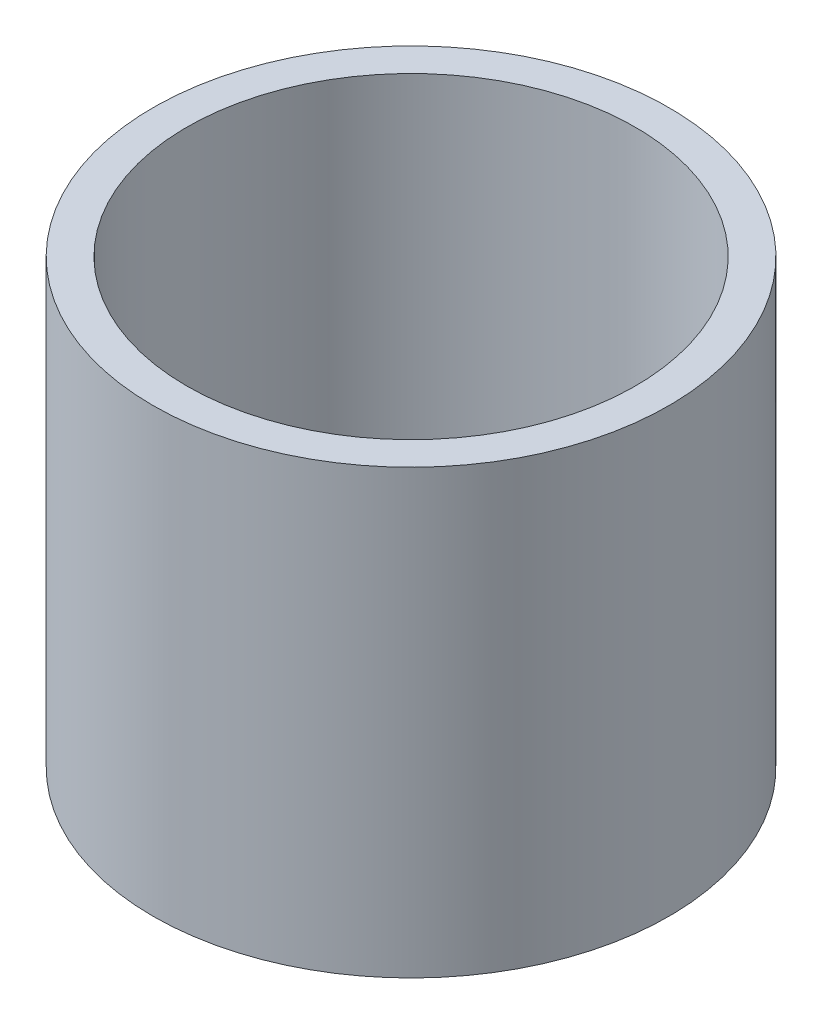
ISO-10303-21;
HEADER;
FILE_DESCRIPTION(('STEP AP214'),'2;1');
FILE_NAME('part.step','',(''),(''),'','','');
FILE_SCHEMA(('AUTOMOTIVE_DESIGN { 1 0 10303 214 1 1 1 1 }'));
ENDSEC;
DATA;
#1=APPLICATION_CONTEXT('core data for automotive mechanical design processes');
#2=APPLICATION_PROTOCOL_DEFINITION('international standard','automotive_design',2000,#1);
#3=PRODUCT_CONTEXT('',#1,'mechanical');
#4=PRODUCT('Part','Part','',(#3));
#5=PRODUCT_RELATED_PRODUCT_CATEGORY('part','',(#4));
#6=PRODUCT_DEFINITION_FORMATION('','',#4);
#7=PRODUCT_DEFINITION_CONTEXT('part definition',#1,'design');
#8=PRODUCT_DEFINITION('design','',#6,#7);
#9=PRODUCT_DEFINITION_SHAPE('','',#8);
#10=(LENGTH_UNIT() NAMED_UNIT(*) SI_UNIT(.MILLI.,.METRE.));
#11=(NAMED_UNIT(*) PLANE_ANGLE_UNIT() SI_UNIT($,.RADIAN.));
#12=(NAMED_UNIT(*) SI_UNIT($,.STERADIAN.) SOLID_ANGLE_UNIT());
#13=UNCERTAINTY_MEASURE_WITH_UNIT(LENGTH_MEASURE(1.E-05),#10,'distance_accuracy_value','');
#14=(GEOMETRIC_REPRESENTATION_CONTEXT(3) GLOBAL_UNCERTAINTY_ASSIGNED_CONTEXT((#13)) GLOBAL_UNIT_ASSIGNED_CONTEXT((#10,
#11,#12)) REPRESENTATION_CONTEXT('',''));
#15=CARTESIAN_POINT('',(0.,0.,0.));
#16=DIRECTION('',(0.,0.,1.));
#17=DIRECTION('',(1.,0.,0.));
#18=AXIS2_PLACEMENT_3D('',#15,#16,#17);
#19=CARTESIAN_POINT('',(0.,76.2,0.));
#20=DIRECTION('',(0.,1.,0.));
#21=DIRECTION('',(0.,0.,1.));
#22=AXIS2_PLACEMENT_3D('',#19,#20,#21);
#23=PLANE('',#22);
#24=CARTESIAN_POINT('',(0.,76.2,0.));
#25=DIRECTION('',(0.,1.,0.));
#26=DIRECTION('',(0.,0.,1.));
#27=AXIS2_PLACEMENT_3D('',#24,#25,#26);
#28=CIRCLE('',#27,44.45);
#29=CARTESIAN_POINT('',(0.,76.2,44.45));
#30=VERTEX_POINT('',#29);
#31=EDGE_CURVE('E10',#30,#30,#28,.T.);
#32=ORIENTED_EDGE('',*,*,#31,.T.);
#33=EDGE_LOOP('',(#32));
#34=FACE_BOUND('',#33,.T.);
#35=CARTESIAN_POINT('',(0.,76.2,0.));
#36=DIRECTION('',(0.,1.,0.));
#37=DIRECTION('',(0.,0.,1.));
#38=AXIS2_PLACEMENT_3D('',#35,#36,#37);
#39=CIRCLE('',#38,38.6334);
#40=CARTESIAN_POINT('',(0.,76.2,38.6334));
#41=VERTEX_POINT('',#40);
#42=EDGE_CURVE('E51',#41,#41,#39,.T.);
#43=ORIENTED_EDGE('',*,*,#42,.F.);
#44=EDGE_LOOP('',(#43));
#45=FACE_BOUND('',#44,.T.);
#46=ADVANCED_FACE('F38',(#34,#45),#23,.T.);
#47=CARTESIAN_POINT('',(0.,0.,0.));
#48=DIRECTION('',(0.,1.,0.));
#49=DIRECTION('',(0.,0.,1.));
#50=AXIS2_PLACEMENT_3D('',#47,#48,#49);
#51=PLANE('',#50);
#52=CARTESIAN_POINT('',(0.,0.,0.));
#53=DIRECTION('',(0.,1.,0.));
#54=DIRECTION('',(0.,0.,1.));
#55=AXIS2_PLACEMENT_3D('',#52,#53,#54);
#56=CIRCLE('',#55,44.45);
#57=CARTESIAN_POINT('',(0.,0.,44.45));
#58=VERTEX_POINT('',#57);
#59=EDGE_CURVE('E42',#58,#58,#56,.T.);
#60=ORIENTED_EDGE('',*,*,#59,.F.);
#61=EDGE_LOOP('',(#60));
#62=FACE_BOUND('',#61,.T.);
#63=CARTESIAN_POINT('',(0.,0.,0.));
#64=DIRECTION('',(0.,1.,0.));
#65=DIRECTION('',(0.,0.,1.));
#66=AXIS2_PLACEMENT_3D('',#63,#64,#65);
#67=CIRCLE('',#66,38.6334);
#68=CARTESIAN_POINT('',(0.,0.,38.6334));
#69=VERTEX_POINT('',#68);
#70=EDGE_CURVE('E53',#69,#69,#67,.T.);
#71=ORIENTED_EDGE('',*,*,#70,.T.);
#72=EDGE_LOOP('',(#71));
#73=FACE_BOUND('',#72,.T.);
#74=ADVANCED_FACE('F65',(#62,#73),#51,.F.);
#75=CARTESIAN_POINT('',(0.,76.2,0.));
#76=DIRECTION('',(0.,-1.,0.));
#77=DIRECTION('',(0.,0.,-1.));
#78=AXIS2_PLACEMENT_3D('',#75,#76,#77);
#79=CYLINDRICAL_SURFACE('',#78,44.45);
#80=ORIENTED_EDGE('',*,*,#31,.F.);
#81=EDGE_LOOP('',(#80));
#82=FACE_BOUND('',#81,.T.);
#83=ORIENTED_EDGE('',*,*,#59,.T.);
#84=EDGE_LOOP('',(#83));
#85=FACE_BOUND('',#84,.T.);
#86=ADVANCED_FACE('F40',(#82,#85),#79,.T.);
#87=CARTESIAN_POINT('',(0.,76.2,0.));
#88=DIRECTION('',(0.,-1.,0.));
#89=DIRECTION('',(0.,0.,-1.));
#90=AXIS2_PLACEMENT_3D('',#87,#88,#89);
#91=CYLINDRICAL_SURFACE('',#90,38.6334);
#92=ORIENTED_EDGE('',*,*,#42,.T.);
#93=EDGE_LOOP('',(#92));
#94=FACE_BOUND('',#93,.T.);
#95=ORIENTED_EDGE('',*,*,#70,.F.);
#96=EDGE_LOOP('',(#95));
#97=FACE_BOUND('',#96,.T.);
#98=ADVANCED_FACE('F61',(#94,#97),#91,.F.);
#99=CLOSED_SHELL('',(#46,#74,#86,#98));
#100=MANIFOLD_SOLID_BREP('B2',#99);
#101=ADVANCED_BREP_SHAPE_REPRESENTATION('',(#18,#100),#14);
#102=SHAPE_DEFINITION_REPRESENTATION(#9,#101);
ENDSEC;
END-ISO-10303-21;
